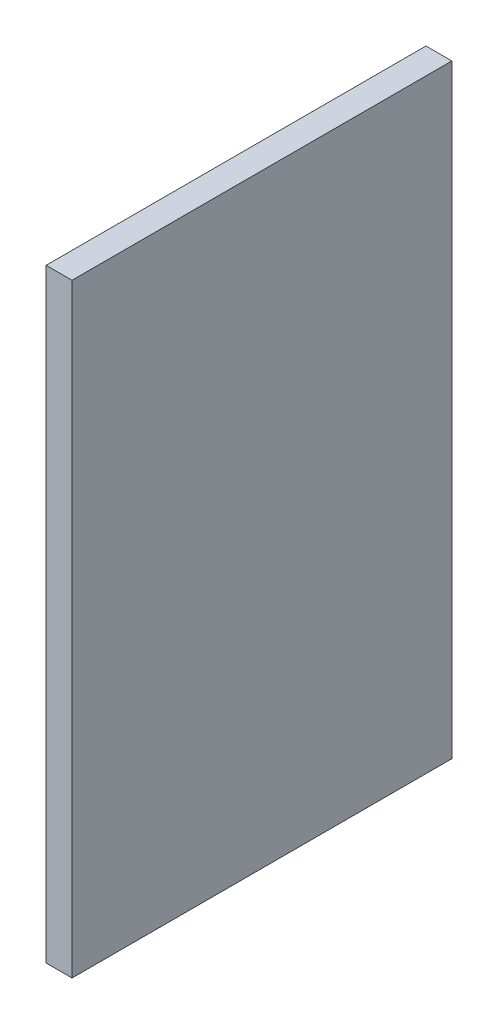
ISO-10303-21;
HEADER;
FILE_DESCRIPTION(('STEP AP214'),'2;1');
FILE_NAME('part.step','',(''),(''),'','','');
FILE_SCHEMA(('AUTOMOTIVE_DESIGN { 1 0 10303 214 1 1 1 1 }'));
ENDSEC;
DATA;
#1=APPLICATION_CONTEXT('core data for automotive mechanical design processes');
#2=APPLICATION_PROTOCOL_DEFINITION('international standard','automotive_design',2000,#1);
#3=PRODUCT_CONTEXT('',#1,'mechanical');
#4=PRODUCT('Part','Part','',(#3));
#5=PRODUCT_RELATED_PRODUCT_CATEGORY('part','',(#4));
#6=PRODUCT_DEFINITION_FORMATION('','',#4);
#7=PRODUCT_DEFINITION_CONTEXT('part definition',#1,'design');
#8=PRODUCT_DEFINITION('design','',#6,#7);
#9=PRODUCT_DEFINITION_SHAPE('','',#8);
#10=(LENGTH_UNIT() NAMED_UNIT(*) SI_UNIT(.MILLI.,.METRE.));
#11=(NAMED_UNIT(*) PLANE_ANGLE_UNIT() SI_UNIT($,.RADIAN.));
#12=(NAMED_UNIT(*) SI_UNIT($,.STERADIAN.) SOLID_ANGLE_UNIT());
#13=UNCERTAINTY_MEASURE_WITH_UNIT(LENGTH_MEASURE(1.E-05),#10,'distance_accuracy_value','');
#14=(GEOMETRIC_REPRESENTATION_CONTEXT(3) GLOBAL_UNCERTAINTY_ASSIGNED_CONTEXT((#13)) GLOBAL_UNIT_ASSIGNED_CONTEXT((#10,
#11,#12)) REPRESENTATION_CONTEXT('',''));
#15=CARTESIAN_POINT('',(0.,0.,0.));
#16=DIRECTION('',(0.,0.,1.));
#17=DIRECTION('',(1.,0.,0.));
#18=AXIS2_PLACEMENT_3D('',#15,#16,#17);
#19=CARTESIAN_POINT('',(15.,175.,-110.));
#20=DIRECTION('',(0.,0.,1.));
#21=DIRECTION('',(0.,-1.,0.));
#22=AXIS2_PLACEMENT_3D('',#19,#20,#21);
#23=PLANE('',#22);
#24=DIRECTION('',(0.,1.,0.));
#25=VECTOR('',#24,1.);
#26=CARTESIAN_POINT('',(0.,175.,-110.));
#27=LINE('',#26,#25);
#28=CARTESIAN_POINT('',(0.,-175.,-110.));
#29=VERTEX_POINT('',#28);
#30=CARTESIAN_POINT('',(0.,175.,-110.));
#31=VERTEX_POINT('',#30);
#32=EDGE_CURVE('E102',#29,#31,#27,.T.);
#33=ORIENTED_EDGE('',*,*,#32,.T.);
#34=DIRECTION('',(-1.,0.,0.));
#35=VECTOR('',#34,1.);
#36=CARTESIAN_POINT('',(15.,175.,-110.));
#37=LINE('',#36,#35);
#38=CARTESIAN_POINT('',(15.,175.,-110.));
#39=VERTEX_POINT('',#38);
#40=EDGE_CURVE('E11',#39,#31,#37,.T.);
#41=ORIENTED_EDGE('',*,*,#40,.F.);
#42=DIRECTION('',(0.,1.,0.));
#43=VECTOR('',#42,1.);
#44=CARTESIAN_POINT('',(15.,175.,-110.));
#45=LINE('',#44,#43);
#46=CARTESIAN_POINT('',(15.,-175.,-110.));
#47=VERTEX_POINT('',#46);
#48=EDGE_CURVE('E90',#47,#39,#45,.T.);
#49=ORIENTED_EDGE('',*,*,#48,.F.);
#50=DIRECTION('',(-1.,0.,0.));
#51=VECTOR('',#50,1.);
#52=CARTESIAN_POINT('',(15.,-175.,-110.));
#53=LINE('',#52,#51);
#54=EDGE_CURVE('E98',#47,#29,#53,.T.);
#55=ORIENTED_EDGE('',*,*,#54,.T.);
#56=EDGE_LOOP('',(#33,#41,#49,#55));
#57=FACE_BOUND('',#56,.T.);
#58=ADVANCED_FACE('F39',(#57),#23,.F.);
#59=CARTESIAN_POINT('',(15.,175.,110.));
#60=DIRECTION('',(0.,-1.,0.));
#61=DIRECTION('',(0.,0.,-1.));
#62=AXIS2_PLACEMENT_3D('',#59,#60,#61);
#63=PLANE('',#62);
#64=DIRECTION('',(0.,0.,1.));
#65=VECTOR('',#64,1.);
#66=CARTESIAN_POINT('',(0.,175.,110.));
#67=LINE('',#66,#65);
#68=CARTESIAN_POINT('',(0.,175.,110.));
#69=VERTEX_POINT('',#68);
#70=EDGE_CURVE('E94',#31,#69,#67,.T.);
#71=ORIENTED_EDGE('',*,*,#70,.T.);
#72=DIRECTION('',(-1.,0.,0.));
#73=VECTOR('',#72,1.);
#74=CARTESIAN_POINT('',(15.,175.,110.));
#75=LINE('',#74,#73);
#76=CARTESIAN_POINT('',(15.,175.,110.));
#77=VERTEX_POINT('',#76);
#78=EDGE_CURVE('E47',#77,#69,#75,.T.);
#79=ORIENTED_EDGE('',*,*,#78,.F.);
#80=DIRECTION('',(0.,0.,1.));
#81=VECTOR('',#80,1.);
#82=CARTESIAN_POINT('',(15.,175.,110.));
#83=LINE('',#82,#81);
#84=EDGE_CURVE('E85',#39,#77,#83,.T.);
#85=ORIENTED_EDGE('',*,*,#84,.F.);
#86=ORIENTED_EDGE('',*,*,#40,.T.);
#87=EDGE_LOOP('',(#71,#79,#85,#86));
#88=FACE_BOUND('',#87,.T.);
#89=ADVANCED_FACE('F93',(#88),#63,.F.);
#90=CARTESIAN_POINT('',(15.,175.,110.));
#91=DIRECTION('',(0.,0.,-1.));
#92=DIRECTION('',(0.,1.,0.));
#93=AXIS2_PLACEMENT_3D('',#90,#91,#92);
#94=PLANE('',#93);
#95=DIRECTION('',(0.,-1.,0.));
#96=VECTOR('',#95,1.);
#97=CARTESIAN_POINT('',(0.,175.,110.));
#98=LINE('',#97,#96);
#99=CARTESIAN_POINT('',(0.,-175.,110.));
#100=VERTEX_POINT('',#99);
#101=EDGE_CURVE('E72',#69,#100,#98,.T.);
#102=ORIENTED_EDGE('',*,*,#101,.T.);
#103=DIRECTION('',(-1.,0.,0.));
#104=VECTOR('',#103,1.);
#105=CARTESIAN_POINT('',(15.,-175.,110.));
#106=LINE('',#105,#104);
#107=CARTESIAN_POINT('',(15.,-175.,110.));
#108=VERTEX_POINT('',#107);
#109=EDGE_CURVE('E95',#108,#100,#106,.T.);
#110=ORIENTED_EDGE('',*,*,#109,.F.);
#111=DIRECTION('',(0.,-1.,0.));
#112=VECTOR('',#111,1.);
#113=CARTESIAN_POINT('',(15.,175.,110.));
#114=LINE('',#113,#112);
#115=EDGE_CURVE('E88',#77,#108,#114,.T.);
#116=ORIENTED_EDGE('',*,*,#115,.F.);
#117=ORIENTED_EDGE('',*,*,#78,.T.);
#118=EDGE_LOOP('',(#102,#110,#116,#117));
#119=FACE_BOUND('',#118,.T.);
#120=ADVANCED_FACE('F96',(#119),#94,.F.);
#121=CARTESIAN_POINT('',(15.,-175.,110.));
#122=DIRECTION('',(0.,1.,0.));
#123=DIRECTION('',(0.,0.,1.));
#124=AXIS2_PLACEMENT_3D('',#121,#122,#123);
#125=PLANE('',#124);
#126=DIRECTION('',(0.,0.,-1.));
#127=VECTOR('',#126,1.);
#128=CARTESIAN_POINT('',(0.,-175.,110.));
#129=LINE('',#128,#127);
#130=EDGE_CURVE('E78',#100,#29,#129,.T.);
#131=ORIENTED_EDGE('',*,*,#130,.T.);
#132=ORIENTED_EDGE('',*,*,#54,.F.);
#133=DIRECTION('',(0.,0.,-1.));
#134=VECTOR('',#133,1.);
#135=CARTESIAN_POINT('',(15.,-175.,110.));
#136=LINE('',#135,#134);
#137=EDGE_CURVE('E55',#108,#47,#136,.T.);
#138=ORIENTED_EDGE('',*,*,#137,.F.);
#139=ORIENTED_EDGE('',*,*,#109,.T.);
#140=EDGE_LOOP('',(#131,#132,#138,#139));
#141=FACE_BOUND('',#140,.T.);
#142=ADVANCED_FACE('F109',(#141),#125,.F.);
#143=CARTESIAN_POINT('',(15.,0.,0.));
#144=DIRECTION('',(1.,0.,0.));
#145=DIRECTION('',(0.,0.,-1.));
#146=AXIS2_PLACEMENT_3D('',#143,#144,#145);
#147=PLANE('',#146);
#148=ORIENTED_EDGE('',*,*,#48,.T.);
#149=ORIENTED_EDGE('',*,*,#84,.T.);
#150=ORIENTED_EDGE('',*,*,#115,.T.);
#151=ORIENTED_EDGE('',*,*,#137,.T.);
#152=EDGE_LOOP('',(#148,#149,#150,#151));
#153=FACE_BOUND('',#152,.T.);
#154=ADVANCED_FACE('F86',(#153),#147,.T.);
#155=CARTESIAN_POINT('',(0.,0.,0.));
#156=DIRECTION('',(1.,0.,0.));
#157=DIRECTION('',(0.,0.,-1.));
#158=AXIS2_PLACEMENT_3D('',#155,#156,#157);
#159=PLANE('',#158);
#160=ORIENTED_EDGE('',*,*,#32,.F.);
#161=ORIENTED_EDGE('',*,*,#130,.F.);
#162=ORIENTED_EDGE('',*,*,#101,.F.);
#163=ORIENTED_EDGE('',*,*,#70,.F.);
#164=EDGE_LOOP('',(#160,#161,#162,#163));
#165=FACE_BOUND('',#164,.T.);
#166=ADVANCED_FACE('F112',(#165),#159,.F.);
#167=CLOSED_SHELL('',(#58,#89,#120,#142,#154,#166));
#168=MANIFOLD_SOLID_BREP('B2',#167);
#169=ADVANCED_BREP_SHAPE_REPRESENTATION('',(#18,#168),#14);
#170=SHAPE_DEFINITION_REPRESENTATION(#9,#169);
ENDSEC;
END-ISO-10303-21;
